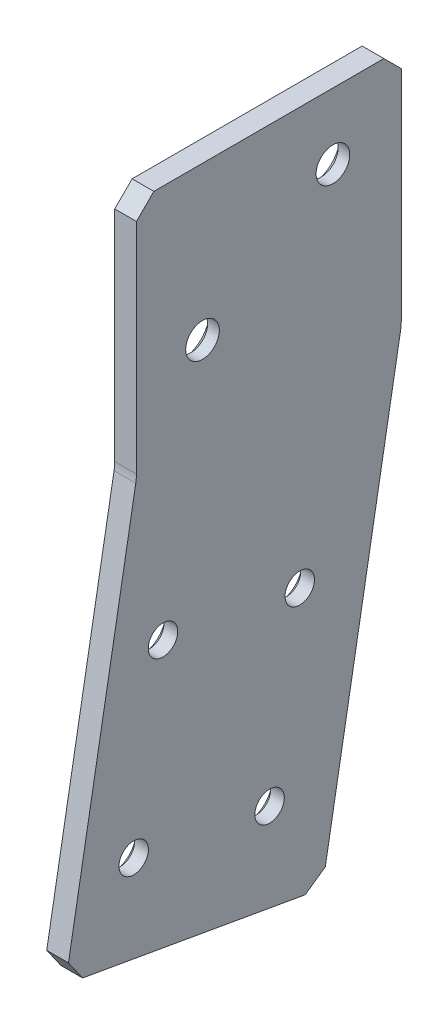
ISO-10303-21;
HEADER;
FILE_DESCRIPTION(('STEP AP214'),'2;1');
FILE_NAME('part.step','',(''),(''),'','','');
FILE_SCHEMA(('AUTOMOTIVE_DESIGN { 1 0 10303 214 1 1 1 1 }'));
ENDSEC;
DATA;
#1=APPLICATION_CONTEXT('core data for automotive mechanical design processes');
#2=APPLICATION_PROTOCOL_DEFINITION('international standard','automotive_design',2000,#1);
#3=PRODUCT_CONTEXT('',#1,'mechanical');
#4=PRODUCT('Part','Part','',(#3));
#5=PRODUCT_RELATED_PRODUCT_CATEGORY('part','',(#4));
#6=PRODUCT_DEFINITION_FORMATION('','',#4);
#7=PRODUCT_DEFINITION_CONTEXT('part definition',#1,'design');
#8=PRODUCT_DEFINITION('design','',#6,#7);
#9=PRODUCT_DEFINITION_SHAPE('','',#8);
#10=(LENGTH_UNIT() NAMED_UNIT(*) SI_UNIT(.MILLI.,.METRE.));
#11=(NAMED_UNIT(*) PLANE_ANGLE_UNIT() SI_UNIT($,.RADIAN.));
#12=(NAMED_UNIT(*) SI_UNIT($,.STERADIAN.) SOLID_ANGLE_UNIT());
#13=UNCERTAINTY_MEASURE_WITH_UNIT(LENGTH_MEASURE(1.E-05),#10,'distance_accuracy_value','');
#14=(GEOMETRIC_REPRESENTATION_CONTEXT(3) GLOBAL_UNCERTAINTY_ASSIGNED_CONTEXT((#13)) GLOBAL_UNIT_ASSIGNED_CONTEXT((#10,
#11,#12)) REPRESENTATION_CONTEXT('',''));
#15=CARTESIAN_POINT('',(0.,0.,0.));
#16=DIRECTION('',(0.,0.,1.));
#17=DIRECTION('',(1.,0.,0.));
#18=AXIS2_PLACEMENT_3D('',#15,#16,#17);
#19=CARTESIAN_POINT('',(1.86082796489774,230.070458845019,-147.775624550014));
#20=DIRECTION('',(0.,0.984807753012208,-0.17364817766693));
#21=DIRECTION('',(0.,0.17364817766693,0.984807753012208));
#22=AXIS2_PLACEMENT_3D('',#19,#20,#21);
#23=PLANE('',#22);
#24=DIRECTION('',(0.,0.17364817766693,0.984807753012208));
#25=VECTOR('',#24,1.);
#26=CARTESIAN_POINT('',(5.03582796489774,230.070458845019,-147.775624550014));
#27=LINE('',#26,#25);
#28=CARTESIAN_POINT('',(5.03582796489774,230.511525216293,-145.274212857363));
#29=VERTEX_POINT('',#28);
#30=CARTESIAN_POINT('',(5.03582796489774,236.245388042855,-112.755860852901));
#31=VERTEX_POINT('',#30);
#32=EDGE_CURVE('E180',#29,#31,#27,.T.);
#33=ORIENTED_EDGE('',*,*,#32,.T.);
#34=DIRECTION('',(-1.,0.,0.));
#35=VECTOR('',#34,1.);
#36=CARTESIAN_POINT('',(1.86082796489774,236.245388042855,-112.755860852901));
#37=LINE('',#36,#35);
#38=CARTESIAN_POINT('',(1.86082796489774,236.245388042855,-112.755860852901));
#39=VERTEX_POINT('',#38);
#40=EDGE_CURVE('E219',#31,#39,#37,.T.);
#41=ORIENTED_EDGE('',*,*,#40,.T.);
#42=DIRECTION('',(0.,0.17364817766693,0.984807753012208));
#43=VECTOR('',#42,1.);
#44=CARTESIAN_POINT('',(1.86082796489774,230.070458845019,-147.775624550014));
#45=LINE('',#44,#43);
#46=CARTESIAN_POINT('',(1.86082796489774,230.511525216293,-145.274212857363));
#47=VERTEX_POINT('',#46);
#48=EDGE_CURVE('E188',#47,#39,#45,.T.);
#49=ORIENTED_EDGE('',*,*,#48,.F.);
#50=DIRECTION('',(1.,0.,0.));
#51=VECTOR('',#50,1.);
#52=CARTESIAN_POINT('',(1.86082796489774,230.511525216293,-145.274212857363));
#53=LINE('',#52,#51);
#54=EDGE_CURVE('E216',#47,#29,#53,.T.);
#55=ORIENTED_EDGE('',*,*,#54,.T.);
#56=EDGE_LOOP('',(#33,#41,#49,#55));
#57=FACE_BOUND('',#56,.T.);
#58=ADVANCED_FACE('F42',(#57),#23,.F.);
#59=CARTESIAN_POINT('',(1.86082796489774,236.686454414129,-110.25444916025));
#60=DIRECTION('',(0.,-0.173648177666931,-0.984807753012208));
#61=DIRECTION('',(0.,0.984807753012208,-0.173648177666931));
#62=AXIS2_PLACEMENT_3D('',#59,#60,#61);
#63=PLANE('',#62);
#64=DIRECTION('',(0.,0.984807753012208,-0.173648177666931));
#65=VECTOR('',#64,1.);
#66=CARTESIAN_POINT('',(1.86082796489774,236.686454414129,-110.25444916025));
#67=LINE('',#66,#65);
#68=CARTESIAN_POINT('',(1.86082796489774,239.18786610678,-110.695515531524));
#69=VERTEX_POINT('',#68);
#70=CARTESIAN_POINT('',(1.86082796489771,294.96406401821,-120.530364104645));
#71=VERTEX_POINT('',#70);
#72=EDGE_CURVE('E275',#69,#71,#67,.T.);
#73=ORIENTED_EDGE('',*,*,#72,.F.);
#74=DIRECTION('',(1.,0.,0.));
#75=VECTOR('',#74,1.);
#76=CARTESIAN_POINT('',(1.86082796489774,239.18786610678,-110.695515531524));
#77=LINE('',#76,#75);
#78=CARTESIAN_POINT('',(5.03582796489774,239.18786610678,-110.695515531524));
#79=VERTEX_POINT('',#78);
#80=EDGE_CURVE('E204',#69,#79,#77,.T.);
#81=ORIENTED_EDGE('',*,*,#80,.T.);
#82=DIRECTION('',(0.,0.984807753012208,-0.173648177666931));
#83=VECTOR('',#82,1.);
#84=CARTESIAN_POINT('',(5.03582796489774,236.686454414129,-110.25444916025));
#85=LINE('',#84,#83);
#86=CARTESIAN_POINT('',(5.03582796489771,294.96406401821,-120.530364104645));
#87=VERTEX_POINT('',#86);
#88=EDGE_CURVE('E172',#79,#87,#85,.T.);
#89=ORIENTED_EDGE('',*,*,#88,.T.);
#90=DIRECTION('',(1.,0.,0.));
#91=VECTOR('',#90,1.);
#92=CARTESIAN_POINT('',(1.86082796489771,294.96406401821,-120.530364104645));
#93=LINE('',#92,#91);
#94=EDGE_CURVE('E149',#87,#71,#93,.F.);
#95=ORIENTED_EDGE('',*,*,#94,.T.);
#96=EDGE_LOOP('',(#73,#81,#89,#95));
#97=FACE_BOUND('',#96,.T.);
#98=ADVANCED_FACE('F285',(#97),#63,.F.);
#99=CARTESIAN_POINT('',(1.8608279648977,330.563176933005,-120.626834873017));
#100=DIRECTION('',(0.,0.,-1.));
#101=DIRECTION('',(0.,1.,0.));
#102=AXIS2_PLACEMENT_3D('',#99,#100,#101);
#103=PLANE('',#102);
#104=DIRECTION('',(0.,1.,0.));
#105=VECTOR('',#104,1.);
#106=CARTESIAN_POINT('',(5.0358279648977,330.563176933005,-120.626834873017));
#107=LINE('',#106,#105);
#108=CARTESIAN_POINT('',(5.03582796489771,296.066729946395,-120.626834873017));
#109=VERTEX_POINT('',#108);
#110=CARTESIAN_POINT('',(5.0358279648977,328.023176933005,-120.626834873017));
#111=VERTEX_POINT('',#110);
#112=EDGE_CURVE('E161',#109,#111,#107,.T.);
#113=ORIENTED_EDGE('',*,*,#112,.T.);
#114=DIRECTION('',(-1.,0.,0.));
#115=VECTOR('',#114,1.);
#116=CARTESIAN_POINT('',(1.8608279648977,328.023176933005,-120.626834873017));
#117=LINE('',#116,#115);
#118=CARTESIAN_POINT('',(1.8608279648977,328.023176933005,-120.626834873017));
#119=VERTEX_POINT('',#118);
#120=EDGE_CURVE('E11',#111,#119,#117,.T.);
#121=ORIENTED_EDGE('',*,*,#120,.T.);
#122=DIRECTION('',(0.,1.,0.));
#123=VECTOR('',#122,1.);
#124=CARTESIAN_POINT('',(1.8608279648977,330.563176933005,-120.626834873017));
#125=LINE('',#124,#123);
#126=CARTESIAN_POINT('',(1.86082796489771,296.066729946395,-120.626834873017));
#127=VERTEX_POINT('',#126);
#128=EDGE_CURVE('E163',#127,#119,#125,.T.);
#129=ORIENTED_EDGE('',*,*,#128,.F.);
#130=DIRECTION('',(1.,0.,0.));
#131=VECTOR('',#130,1.);
#132=CARTESIAN_POINT('',(5.03582796489771,296.066729946395,-120.626834873017));
#133=LINE('',#132,#131);
#134=EDGE_CURVE('E147',#127,#109,#133,.T.);
#135=ORIENTED_EDGE('',*,*,#134,.T.);
#136=EDGE_LOOP('',(#113,#121,#129,#135));
#137=FACE_BOUND('',#136,.T.);
#138=ADVANCED_FACE('F160',(#137),#103,.F.);
#139=CARTESIAN_POINT('',(1.8608279648977,330.563176933005,-159.314588785863));
#140=DIRECTION('',(0.,-1.,0.));
#141=DIRECTION('',(1.,0.,0.));
#142=AXIS2_PLACEMENT_3D('',#139,#140,#141);
#143=PLANE('',#142);
#144=DIRECTION('',(0.,0.,-1.));
#145=VECTOR('',#144,1.);
#146=CARTESIAN_POINT('',(5.0358279648977,330.563176933005,-159.314588785863));
#147=LINE('',#146,#145);
#148=CARTESIAN_POINT('',(5.0358279648977,330.563176933005,-123.166834873017));
#149=VERTEX_POINT('',#148);
#150=CARTESIAN_POINT('',(5.0358279648977,330.563176933005,-156.774588785863));
#151=VERTEX_POINT('',#150);
#152=EDGE_CURVE('E171',#149,#151,#147,.T.);
#153=ORIENTED_EDGE('',*,*,#152,.T.);
#154=DIRECTION('',(-1.,0.,0.));
#155=VECTOR('',#154,1.);
#156=CARTESIAN_POINT('',(1.8608279648977,330.563176933005,-156.774588785863));
#157=LINE('',#156,#155);
#158=CARTESIAN_POINT('',(1.8608279648977,330.563176933005,-156.774588785863));
#159=VERTEX_POINT('',#158);
#160=EDGE_CURVE('E51',#151,#159,#157,.T.);
#161=ORIENTED_EDGE('',*,*,#160,.T.);
#162=DIRECTION('',(0.,0.,-1.));
#163=VECTOR('',#162,1.);
#164=CARTESIAN_POINT('',(1.8608279648977,330.563176933005,-159.314588785863));
#165=LINE('',#164,#163);
#166=CARTESIAN_POINT('',(1.8608279648977,330.563176933005,-123.166834873017));
#167=VERTEX_POINT('',#166);
#168=EDGE_CURVE('E240',#167,#159,#165,.T.);
#169=ORIENTED_EDGE('',*,*,#168,.F.);
#170=DIRECTION('',(1.,0.,0.));
#171=VECTOR('',#170,1.);
#172=CARTESIAN_POINT('',(1.8608279648977,330.563176933005,-123.166834873017));
#173=LINE('',#172,#171);
#174=EDGE_CURVE('E234',#167,#149,#173,.T.);
#175=ORIENTED_EDGE('',*,*,#174,.T.);
#176=EDGE_LOOP('',(#153,#161,#169,#175));
#177=FACE_BOUND('',#176,.T.);
#178=ADVANCED_FACE('F239',(#177),#143,.F.);
#179=CARTESIAN_POINT('',(1.86082796489771,295.511176933005,-159.314588785863));
#180=DIRECTION('',(0.,0.,1.));
#181=DIRECTION('',(0.,-1.,0.));
#182=AXIS2_PLACEMENT_3D('',#179,#180,#181);
#183=PLANE('',#182);
#184=DIRECTION('',(0.,-1.,0.));
#185=VECTOR('',#184,1.);
#186=CARTESIAN_POINT('',(1.86082796489771,295.511176933005,-159.314588785863));
#187=LINE('',#186,#185);
#188=CARTESIAN_POINT('',(1.8608279648977,328.023176933005,-159.314588785863));
#189=VERTEX_POINT('',#188);
#190=CARTESIAN_POINT('',(1.86082796489771,296.066729946395,-159.314588785863));
#191=VERTEX_POINT('',#190);
#192=EDGE_CURVE('E250',#189,#191,#187,.T.);
#193=ORIENTED_EDGE('',*,*,#192,.F.);
#194=DIRECTION('',(1.,0.,0.));
#195=VECTOR('',#194,1.);
#196=CARTESIAN_POINT('',(1.8608279648977,328.023176933005,-159.314588785863));
#197=LINE('',#196,#195);
#198=CARTESIAN_POINT('',(5.0358279648977,328.023176933005,-159.314588785863));
#199=VERTEX_POINT('',#198);
#200=EDGE_CURVE('E231',#189,#199,#197,.T.);
#201=ORIENTED_EDGE('',*,*,#200,.T.);
#202=DIRECTION('',(0.,-1.,0.));
#203=VECTOR('',#202,1.);
#204=CARTESIAN_POINT('',(5.03582796489771,295.511176933005,-159.314588785863));
#205=LINE('',#204,#203);
#206=CARTESIAN_POINT('',(5.03582796489771,296.066729946395,-159.314588785863));
#207=VERTEX_POINT('',#206);
#208=EDGE_CURVE('E177',#199,#207,#205,.T.);
#209=ORIENTED_EDGE('',*,*,#208,.T.);
#210=DIRECTION('',(1.,0.,0.));
#211=VECTOR('',#210,1.);
#212=CARTESIAN_POINT('',(1.86082796489771,296.066729946395,-159.314588785863));
#213=LINE('',#212,#211);
#214=EDGE_CURVE('E198',#207,#191,#213,.F.);
#215=ORIENTED_EDGE('',*,*,#214,.T.);
#216=EDGE_LOOP('',(#193,#201,#209,#215));
#217=FACE_BOUND('',#216,.T.);
#218=ADVANCED_FACE('F249',(#217),#183,.F.);
#219=CARTESIAN_POINT('',(1.86082796489774,230.070458845019,-147.775624550014));
#220=DIRECTION('',(0.,0.173648177666931,0.984807753012208));
#221=DIRECTION('',(0.,-0.984807753012208,0.173648177666931));
#222=AXIS2_PLACEMENT_3D('',#219,#220,#221);
#223=PLANE('',#222);
#224=DIRECTION('',(0.,-0.984807753012208,0.173648177666931));
#225=VECTOR('',#224,1.);
#226=CARTESIAN_POINT('',(5.03582796489774,230.070458845019,-147.775624550014));
#227=LINE('',#226,#225);
#228=CARTESIAN_POINT('',(5.03582796489771,294.96406401821,-159.21811801749));
#229=VERTEX_POINT('',#228);
#230=CARTESIAN_POINT('',(5.03582796489774,232.57187053767,-148.216690921288));
#231=VERTEX_POINT('',#230);
#232=EDGE_CURVE('E186',#229,#231,#227,.T.);
#233=ORIENTED_EDGE('',*,*,#232,.T.);
#234=DIRECTION('',(-1.,0.,0.));
#235=VECTOR('',#234,1.);
#236=CARTESIAN_POINT('',(1.86082796489774,232.57187053767,-148.216690921288));
#237=LINE('',#236,#235);
#238=CARTESIAN_POINT('',(1.86082796489774,232.57187053767,-148.216690921288));
#239=VERTEX_POINT('',#238);
#240=EDGE_CURVE('E229',#231,#239,#237,.T.);
#241=ORIENTED_EDGE('',*,*,#240,.T.);
#242=DIRECTION('',(0.,-0.984807753012208,0.173648177666931));
#243=VECTOR('',#242,1.);
#244=CARTESIAN_POINT('',(1.86082796489774,230.070458845019,-147.775624550014));
#245=LINE('',#244,#243);
#246=CARTESIAN_POINT('',(1.86082796489771,294.96406401821,-159.21811801749));
#247=VERTEX_POINT('',#246);
#248=EDGE_CURVE('E165',#247,#239,#245,.T.);
#249=ORIENTED_EDGE('',*,*,#248,.F.);
#250=DIRECTION('',(1.,0.,0.));
#251=VECTOR('',#250,1.);
#252=CARTESIAN_POINT('',(1.86082796489771,294.96406401821,-159.21811801749));
#253=LINE('',#252,#251);
#254=EDGE_CURVE('E192',#247,#229,#253,.T.);
#255=ORIENTED_EDGE('',*,*,#254,.T.);
#256=EDGE_LOOP('',(#233,#241,#249,#255));
#257=FACE_BOUND('',#256,.T.);
#258=ADVANCED_FACE('F320',(#257),#223,.F.);
#259=CARTESIAN_POINT('',(1.86082796489783,0.,0.));
#260=DIRECTION('',(-1.,0.,0.));
#261=DIRECTION('',(0.,-1.,0.));
#262=AXIS2_PLACEMENT_3D('',#259,#260,#261);
#263=PLANE('',#262);
#264=CARTESIAN_POINT('',(1.8608279648977,320.911176933005,-149.328834873017));
#265=DIRECTION('',(-1.,0.,0.));
#266=DIRECTION('',(0.,0.,1.));
#267=AXIS2_PLACEMENT_3D('',#264,#265,#266);
#268=CIRCLE('',#267,4.21640000000001);
#269=CARTESIAN_POINT('',(1.8608279648977,320.911176933005,-145.112434873017));
#270=VERTEX_POINT('',#269);
#271=EDGE_CURVE('E573',#270,#270,#268,.T.);
#272=ORIENTED_EDGE('',*,*,#271,.F.);
#273=EDGE_LOOP('',(#272));
#274=FACE_BOUND('',#273,.T.);
#275=CARTESIAN_POINT('',(1.86082796489771,308.211176933005,-130.278834873017));
#276=DIRECTION('',(-1.,0.,0.));
#277=DIRECTION('',(0.,0.,1.));
#278=AXIS2_PLACEMENT_3D('',#275,#276,#277);
#279=CIRCLE('',#278,4.21640000000001);
#280=CARTESIAN_POINT('',(1.86082796489771,308.211176933005,-126.062434873017));
#281=VERTEX_POINT('',#280);
#282=EDGE_CURVE('E561',#281,#281,#279,.T.);
#283=ORIENTED_EDGE('',*,*,#282,.F.);
#284=EDGE_LOOP('',(#283));
#285=FACE_BOUND('',#284,.T.);
#286=CARTESIAN_POINT('',(1.86082796489772,273.13941545584,-124.504125042983));
#287=DIRECTION('',(-1.,0.,0.));
#288=DIRECTION('',(0.,0.,1.));
#289=AXIS2_PLACEMENT_3D('',#286,#287,#288);
#290=CIRCLE('',#289,3.54329999999997);
#291=CARTESIAN_POINT('',(1.86082796489772,273.13941545584,-120.960825042983));
#292=VERTEX_POINT('',#291);
#293=EDGE_CURVE('E552',#292,#292,#290,.T.);
#294=ORIENTED_EDGE('',*,*,#293,.F.);
#295=EDGE_LOOP('',(#294));
#296=FACE_BOUND('',#295,.T.);
#297=CARTESIAN_POINT('',(1.86082796489772,269.72417914843,-144.485224024571));
#298=DIRECTION('',(-1.,0.,0.));
#299=DIRECTION('',(0.,0.,1.));
#300=AXIS2_PLACEMENT_3D('',#297,#298,#299);
#301=CIRCLE('',#300,3.54329999999997);
#302=CARTESIAN_POINT('',(1.86082796489772,269.72417914843,-140.941924024571));
#303=VERTEX_POINT('',#302);
#304=EDGE_CURVE('E543',#303,#303,#301,.T.);
#305=ORIENTED_EDGE('',*,*,#304,.F.);
#306=EDGE_LOOP('',(#305));
#307=FACE_BOUND('',#306,.T.);
#308=CARTESIAN_POINT('',(1.86082796489773,244.32417914843,-140.075144867288));
#309=DIRECTION('',(-1.,0.,0.));
#310=DIRECTION('',(0.,0.,1.));
#311=AXIS2_PLACEMENT_3D('',#308,#309,#310);
#312=CIRCLE('',#311,3.5433);
#313=CARTESIAN_POINT('',(1.86082796489773,244.32417914843,-136.531844867288));
#314=VERTEX_POINT('',#313);
#315=EDGE_CURVE('E534',#314,#314,#312,.T.);
#316=ORIENTED_EDGE('',*,*,#315,.F.);
#317=EDGE_LOOP('',(#316));
#318=FACE_BOUND('',#317,.T.);
#319=CARTESIAN_POINT('',(1.86082796489773,247.716621745922,-120.227402213944));
#320=DIRECTION('',(-1.,0.,0.));
#321=DIRECTION('',(0.,0.,1.));
#322=AXIS2_PLACEMENT_3D('',#319,#320,#321);
#323=CIRCLE('',#322,3.54330000000003);
#324=CARTESIAN_POINT('',(1.86082796489773,247.716621745922,-116.684102213944));
#325=VERTEX_POINT('',#324);
#326=EDGE_CURVE('E269',#325,#325,#323,.T.);
#327=ORIENTED_EDGE('',*,*,#326,.F.);
#328=EDGE_LOOP('',(#327));
#329=FACE_BOUND('',#328,.T.);
#330=ORIENTED_EDGE('',*,*,#48,.T.);
#331=DIRECTION('',(0.,-0.819152044288992,-0.573576436351046));
#332=VECTOR('',#331,1.);
#333=CARTESIAN_POINT('',(1.86082796489777,130.700278479122,-186.659342190597));
#334=LINE('',#333,#332);
#335=EDGE_CURVE('E227',#39,#69,#334,.F.);
#336=ORIENTED_EDGE('',*,*,#335,.T.);
#337=ORIENTED_EDGE('',*,*,#72,.T.);
#338=CARTESIAN_POINT('',(1.86082796489771,296.066729946395,-114.276834873017));
#339=DIRECTION('',(-1.,0.,0.));
#340=DIRECTION('',(0.,-1.,0.));
#341=AXIS2_PLACEMENT_3D('',#338,#339,#340);
#342=CIRCLE('',#341,6.35);
#343=EDGE_CURVE('E154',#71,#127,#342,.F.);
#344=ORIENTED_EDGE('',*,*,#343,.T.);
#345=ORIENTED_EDGE('',*,*,#128,.T.);
#346=DIRECTION('',(0.,-0.707106781186548,0.707106781186548));
#347=VECTOR('',#346,1.);
#348=CARTESIAN_POINT('',(1.8608279648978,103.698171029994,103.698171029994));
#349=LINE('',#348,#347);
#350=EDGE_CURVE('E67',#119,#167,#349,.F.);
#351=ORIENTED_EDGE('',*,*,#350,.T.);
#352=ORIENTED_EDGE('',*,*,#168,.T.);
#353=DIRECTION('',(0.,0.707106781186548,0.707106781186548));
#354=VECTOR('',#353,1.);
#355=CARTESIAN_POINT('',(1.86082796489773,243.668882859434,-243.668882859434));
#356=LINE('',#355,#354);
#357=EDGE_CURVE('E223',#159,#189,#356,.F.);
#358=ORIENTED_EDGE('',*,*,#357,.T.);
#359=ORIENTED_EDGE('',*,*,#192,.T.);
#360=CARTESIAN_POINT('',(1.86082796489771,296.066729946395,-152.964588785863));
#361=DIRECTION('',(-1.,0.,0.));
#362=DIRECTION('',(0.,-1.,0.));
#363=AXIS2_PLACEMENT_3D('',#360,#361,#362);
#364=CIRCLE('',#363,6.35);
#365=EDGE_CURVE('E155',#191,#247,#364,.T.);
#366=ORIENTED_EDGE('',*,*,#365,.T.);
#367=ORIENTED_EDGE('',*,*,#248,.T.);
#368=DIRECTION('',(0.,0.573576436351044,-0.819152044288993));
#369=VECTOR('',#368,1.);
#370=CARTESIAN_POINT('',(1.8608279648978,86.419002148222,60.5112367487458));
#371=LINE('',#370,#369);
#372=EDGE_CURVE('E225',#239,#47,#371,.F.);
#373=ORIENTED_EDGE('',*,*,#372,.T.);
#374=EDGE_LOOP('',(#330,#336,#337,#344,#345,#351,#352,#358,#359,#366,#367,#373));
#375=FACE_BOUND('',#374,.T.);
#376=ADVANCED_FACE('F278',(#274,#285,#296,#307,#318,#329,#375),#263,.T.);
#377=CARTESIAN_POINT('',(5.03582796489783,0.,0.));
#378=DIRECTION('',(-1.,0.,0.));
#379=DIRECTION('',(0.,-1.,0.));
#380=AXIS2_PLACEMENT_3D('',#377,#378,#379);
#381=PLANE('',#380);
#382=CARTESIAN_POINT('',(5.03582796489777,320.911176933005,-149.328834873017));
#383=DIRECTION('',(-1.,0.,0.));
#384=DIRECTION('',(0.,0.,1.));
#385=AXIS2_PLACEMENT_3D('',#382,#383,#384);
#386=CIRCLE('',#385,2.45744999999997);
#387=CARTESIAN_POINT('',(5.03582796489777,320.911176933005,-146.871384873017));
#388=VERTEX_POINT('',#387);
#389=EDGE_CURVE('E565',#388,#388,#386,.T.);
#390=ORIENTED_EDGE('',*,*,#389,.T.);
#391=EDGE_LOOP('',(#390));
#392=FACE_BOUND('',#391,.T.);
#393=CARTESIAN_POINT('',(5.03582796489778,308.211176933005,-130.278834873017));
#394=DIRECTION('',(-1.,0.,0.));
#395=DIRECTION('',(0.,0.,1.));
#396=AXIS2_PLACEMENT_3D('',#393,#394,#395);
#397=CIRCLE('',#396,2.45744999999997);
#398=CARTESIAN_POINT('',(5.03582796489778,308.211176933005,-127.821384873017));
#399=VERTEX_POINT('',#398);
#400=EDGE_CURVE('E555',#399,#399,#397,.T.);
#401=ORIENTED_EDGE('',*,*,#400,.T.);
#402=EDGE_LOOP('',(#401));
#403=FACE_BOUND('',#402,.T.);
#404=CARTESIAN_POINT('',(5.03582796489776,273.13941545584,-124.504125042983));
#405=DIRECTION('',(-1.,0.,0.));
#406=DIRECTION('',(0.,0.,1.));
#407=AXIS2_PLACEMENT_3D('',#404,#405,#406);
#408=CIRCLE('',#407,2.15264999999998);
#409=CARTESIAN_POINT('',(5.03582796489776,273.13941545584,-122.351475042983));
#410=VERTEX_POINT('',#409);
#411=EDGE_CURVE('E546',#410,#410,#408,.T.);
#412=ORIENTED_EDGE('',*,*,#411,.T.);
#413=EDGE_LOOP('',(#412));
#414=FACE_BOUND('',#413,.T.);
#415=CARTESIAN_POINT('',(5.03582796489776,269.72417914843,-144.485224024571));
#416=DIRECTION('',(-1.,0.,0.));
#417=DIRECTION('',(0.,0.,1.));
#418=AXIS2_PLACEMENT_3D('',#415,#416,#417);
#419=CIRCLE('',#418,2.15264999999998);
#420=CARTESIAN_POINT('',(5.03582796489776,269.72417914843,-142.332574024571));
#421=VERTEX_POINT('',#420);
#422=EDGE_CURVE('E537',#421,#421,#419,.T.);
#423=ORIENTED_EDGE('',*,*,#422,.T.);
#424=EDGE_LOOP('',(#423));
#425=FACE_BOUND('',#424,.T.);
#426=CARTESIAN_POINT('',(5.03582796489777,244.32417914843,-140.075144867288));
#427=DIRECTION('',(-1.,0.,0.));
#428=DIRECTION('',(0.,0.,1.));
#429=AXIS2_PLACEMENT_3D('',#426,#427,#428);
#430=CIRCLE('',#429,2.15265000000001);
#431=CARTESIAN_POINT('',(5.03582796489777,244.32417914843,-137.922494867288));
#432=VERTEX_POINT('',#431);
#433=EDGE_CURVE('E527',#432,#432,#430,.T.);
#434=ORIENTED_EDGE('',*,*,#433,.T.);
#435=EDGE_LOOP('',(#434));
#436=FACE_BOUND('',#435,.T.);
#437=CARTESIAN_POINT('',(5.03582796489777,247.716621745922,-120.227402213944));
#438=DIRECTION('',(-1.,0.,0.));
#439=DIRECTION('',(0.,0.,1.));
#440=AXIS2_PLACEMENT_3D('',#437,#438,#439);
#441=CIRCLE('',#440,2.15265000000001);
#442=CARTESIAN_POINT('',(5.03582796489777,247.716621745922,-118.074752213944));
#443=VERTEX_POINT('',#442);
#444=EDGE_CURVE('E259',#443,#443,#441,.T.);
#445=ORIENTED_EDGE('',*,*,#444,.T.);
#446=EDGE_LOOP('',(#445));
#447=FACE_BOUND('',#446,.T.);
#448=ORIENTED_EDGE('',*,*,#88,.F.);
#449=DIRECTION('',(0.,0.819152044288992,0.573576436351046));
#450=VECTOR('',#449,1.);
#451=CARTESIAN_POINT('',(5.03582796489774,239.18786610678,-110.695515531524));
#452=LINE('',#451,#450);
#453=EDGE_CURVE('E214',#79,#31,#452,.F.);
#454=ORIENTED_EDGE('',*,*,#453,.T.);
#455=ORIENTED_EDGE('',*,*,#32,.F.);
#456=DIRECTION('',(0.,-0.573576436351044,0.819152044288993));
#457=VECTOR('',#456,1.);
#458=CARTESIAN_POINT('',(5.03582796489774,230.511525216293,-145.274212857363));
#459=LINE('',#458,#457);
#460=EDGE_CURVE('E212',#29,#231,#459,.F.);
#461=ORIENTED_EDGE('',*,*,#460,.T.);
#462=ORIENTED_EDGE('',*,*,#232,.F.);
#463=CARTESIAN_POINT('',(5.03582796489771,296.066729946395,-152.964588785863));
#464=DIRECTION('',(-1.,0.,0.));
#465=DIRECTION('',(0.,-1.,0.));
#466=AXIS2_PLACEMENT_3D('',#463,#464,#465);
#467=CIRCLE('',#466,6.35);
#468=EDGE_CURVE('E195',#229,#207,#467,.F.);
#469=ORIENTED_EDGE('',*,*,#468,.T.);
#470=ORIENTED_EDGE('',*,*,#208,.F.);
#471=DIRECTION('',(0.,-0.707106781186548,-0.707106781186548));
#472=VECTOR('',#471,1.);
#473=CARTESIAN_POINT('',(5.0358279648977,328.023176933005,-159.314588785863));
#474=LINE('',#473,#472);
#475=EDGE_CURVE('E209',#199,#151,#474,.F.);
#476=ORIENTED_EDGE('',*,*,#475,.T.);
#477=ORIENTED_EDGE('',*,*,#152,.F.);
#478=DIRECTION('',(0.,0.707106781186548,-0.707106781186548));
#479=VECTOR('',#478,1.);
#480=CARTESIAN_POINT('',(5.0358279648977,330.563176933005,-123.166834873017));
#481=LINE('',#480,#479);
#482=EDGE_CURVE('E169',#149,#111,#481,.F.);
#483=ORIENTED_EDGE('',*,*,#482,.T.);
#484=ORIENTED_EDGE('',*,*,#112,.F.);
#485=CARTESIAN_POINT('',(5.03582796489771,296.066729946395,-114.276834873017));
#486=DIRECTION('',(-1.,0.,0.));
#487=DIRECTION('',(0.,-1.,0.));
#488=AXIS2_PLACEMENT_3D('',#485,#486,#487);
#489=CIRCLE('',#488,6.35);
#490=EDGE_CURVE('E143',#109,#87,#489,.T.);
#491=ORIENTED_EDGE('',*,*,#490,.T.);
#492=EDGE_LOOP('',(#448,#454,#455,#461,#462,#469,#470,#476,#477,#483,#484,#491));
#493=FACE_BOUND('',#492,.T.);
#494=ADVANCED_FACE('F167',(#392,#403,#414,#425,#436,#447,#493),#381,.F.);
#495=CARTESIAN_POINT('',(1.86082796489771,296.066729946395,-114.276834873017));
#496=DIRECTION('',(-1.,0.,0.));
#497=DIRECTION('',(0.,-1.,0.));
#498=AXIS2_PLACEMENT_3D('',#495,#496,#497);
#499=CYLINDRICAL_SURFACE('',#498,6.35);
#500=ORIENTED_EDGE('',*,*,#343,.F.);
#501=ORIENTED_EDGE('',*,*,#94,.F.);
#502=ORIENTED_EDGE('',*,*,#490,.F.);
#503=ORIENTED_EDGE('',*,*,#134,.F.);
#504=EDGE_LOOP('',(#500,#501,#502,#503));
#505=FACE_BOUND('',#504,.T.);
#506=ADVANCED_FACE('F146',(#505),#499,.F.);
#507=CARTESIAN_POINT('',(1.86082796489771,296.066729946395,-152.964588785863));
#508=DIRECTION('',(1.,0.,0.));
#509=DIRECTION('',(0.,1.,0.));
#510=AXIS2_PLACEMENT_3D('',#507,#508,#509);
#511=CYLINDRICAL_SURFACE('',#510,6.35);
#512=ORIENTED_EDGE('',*,*,#365,.F.);
#513=ORIENTED_EDGE('',*,*,#214,.F.);
#514=ORIENTED_EDGE('',*,*,#468,.F.);
#515=ORIENTED_EDGE('',*,*,#254,.F.);
#516=EDGE_LOOP('',(#512,#513,#514,#515));
#517=FACE_BOUND('',#516,.T.);
#518=ADVANCED_FACE('F296',(#517),#511,.T.);
#519=CARTESIAN_POINT('',(1.86082796489773,247.716621745922,-120.227402213944));
#520=DIRECTION('',(-1.,0.,0.));
#521=DIRECTION('',(0.,0.,1.));
#522=AXIS2_PLACEMENT_3D('',#519,#520,#521);
#523=CYLINDRICAL_SURFACE('',#522,2.15264999999999);
#524=ORIENTED_EDGE('',*,*,#444,.F.);
#525=EDGE_LOOP('',(#524));
#526=FACE_BOUND('',#525,.T.);
#527=CARTESIAN_POINT('',(3.02772186699441,247.716621745922,-120.227402213944));
#528=DIRECTION('',(-1.,0.,0.));
#529=DIRECTION('',(0.,0.,1.));
#530=AXIS2_PLACEMENT_3D('',#527,#528,#529);
#531=CIRCLE('',#530,2.15264999999998);
#532=CARTESIAN_POINT('',(3.02772186699441,247.716621745922,-118.074752213944));
#533=VERTEX_POINT('',#532);
#534=EDGE_CURVE('E264',#533,#533,#531,.T.);
#535=ORIENTED_EDGE('',*,*,#534,.T.);
#536=EDGE_LOOP('',(#535));
#537=FACE_BOUND('',#536,.T.);
#538=ADVANCED_FACE('F299',(#526,#537),#523,.F.);
#539=CARTESIAN_POINT('',(1.86082796489773,247.716621745922,-120.227402213944));
#540=DIRECTION('',(-1.,0.,0.));
#541=DIRECTION('',(0.,0.,1.));
#542=AXIS2_PLACEMENT_3D('',#539,#540,#541);
#543=CONICAL_SURFACE('',#542,3.54330000000003,0.872664625997184);
#544=ORIENTED_EDGE('',*,*,#534,.F.);
#545=EDGE_LOOP('',(#544));
#546=FACE_BOUND('',#545,.T.);
#547=ORIENTED_EDGE('',*,*,#326,.T.);
#548=EDGE_LOOP('',(#547));
#549=FACE_BOUND('',#548,.T.);
#550=ADVANCED_FACE('F466',(#546,#549),#543,.F.);
#551=CARTESIAN_POINT('',(1.86082796489773,244.32417914843,-140.075144867288));
#552=DIRECTION('',(-1.,0.,0.));
#553=DIRECTION('',(0.,0.,1.));
#554=AXIS2_PLACEMENT_3D('',#551,#552,#553);
#555=CYLINDRICAL_SURFACE('',#554,2.15264999999999);
#556=ORIENTED_EDGE('',*,*,#433,.F.);
#557=EDGE_LOOP('',(#556));
#558=FACE_BOUND('',#557,.T.);
#559=CARTESIAN_POINT('',(3.02772186699441,244.32417914843,-140.075144867288));
#560=DIRECTION('',(-1.,0.,0.));
#561=DIRECTION('',(0.,0.,1.));
#562=AXIS2_PLACEMENT_3D('',#559,#560,#561);
#563=CIRCLE('',#562,2.15264999999998);
#564=CARTESIAN_POINT('',(3.02772186699441,244.32417914843,-137.922494867288));
#565=VERTEX_POINT('',#564);
#566=EDGE_CURVE('E529',#565,#565,#563,.T.);
#567=ORIENTED_EDGE('',*,*,#566,.T.);
#568=EDGE_LOOP('',(#567));
#569=FACE_BOUND('',#568,.T.);
#570=ADVANCED_FACE('F458',(#558,#569),#555,.F.);
#571=CARTESIAN_POINT('',(1.86082796489773,244.32417914843,-140.075144867288));
#572=DIRECTION('',(-1.,0.,0.));
#573=DIRECTION('',(0.,0.,1.));
#574=AXIS2_PLACEMENT_3D('',#571,#572,#573);
#575=CONICAL_SURFACE('',#574,3.5433,0.872664625997174);
#576=ORIENTED_EDGE('',*,*,#566,.F.);
#577=EDGE_LOOP('',(#576));
#578=FACE_BOUND('',#577,.T.);
#579=ORIENTED_EDGE('',*,*,#315,.T.);
#580=EDGE_LOOP('',(#579));
#581=FACE_BOUND('',#580,.T.);
#582=ADVANCED_FACE('F450',(#578,#581),#575,.F.);
#583=CARTESIAN_POINT('',(1.86082796489772,269.72417914843,-144.485224024571));
#584=DIRECTION('',(-1.,0.,0.));
#585=DIRECTION('',(0.,0.,1.));
#586=AXIS2_PLACEMENT_3D('',#583,#584,#585);
#587=CYLINDRICAL_SURFACE('',#586,2.15264999999998);
#588=ORIENTED_EDGE('',*,*,#422,.F.);
#589=EDGE_LOOP('',(#588));
#590=FACE_BOUND('',#589,.T.);
#591=CARTESIAN_POINT('',(3.0277218669944,269.72417914843,-144.485224024571));
#592=DIRECTION('',(-1.,0.,0.));
#593=DIRECTION('',(0.,0.,1.));
#594=AXIS2_PLACEMENT_3D('',#591,#592,#593);
#595=CIRCLE('',#594,2.15264999999998);
#596=CARTESIAN_POINT('',(3.0277218669944,269.72417914843,-142.332574024571));
#597=VERTEX_POINT('',#596);
#598=EDGE_CURVE('E540',#597,#597,#595,.T.);
#599=ORIENTED_EDGE('',*,*,#598,.T.);
#600=EDGE_LOOP('',(#599));
#601=FACE_BOUND('',#600,.T.);
#602=ADVANCED_FACE('F442',(#590,#601),#587,.F.);
#603=CARTESIAN_POINT('',(1.86082796489772,269.72417914843,-144.485224024571));
#604=DIRECTION('',(-1.,0.,0.));
#605=DIRECTION('',(0.,0.,1.));
#606=AXIS2_PLACEMENT_3D('',#603,#604,#605);
#607=CONICAL_SURFACE('',#606,3.54329999999997,0.872664625997165);
#608=ORIENTED_EDGE('',*,*,#598,.F.);
#609=EDGE_LOOP('',(#608));
#610=FACE_BOUND('',#609,.T.);
#611=ORIENTED_EDGE('',*,*,#304,.T.);
#612=EDGE_LOOP('',(#611));
#613=FACE_BOUND('',#612,.T.);
#614=ADVANCED_FACE('F434',(#610,#613),#607,.F.);
#615=CARTESIAN_POINT('',(1.86082796489772,273.13941545584,-124.504125042983));
#616=DIRECTION('',(-1.,0.,0.));
#617=DIRECTION('',(0.,0.,1.));
#618=AXIS2_PLACEMENT_3D('',#615,#616,#617);
#619=CYLINDRICAL_SURFACE('',#618,2.15264999999998);
#620=ORIENTED_EDGE('',*,*,#411,.F.);
#621=EDGE_LOOP('',(#620));
#622=FACE_BOUND('',#621,.T.);
#623=CARTESIAN_POINT('',(3.0277218669944,273.13941545584,-124.504125042983));
#624=DIRECTION('',(-1.,0.,0.));
#625=DIRECTION('',(0.,0.,1.));
#626=AXIS2_PLACEMENT_3D('',#623,#624,#625);
#627=CIRCLE('',#626,2.15264999999998);
#628=CARTESIAN_POINT('',(3.0277218669944,273.13941545584,-122.351475042983));
#629=VERTEX_POINT('',#628);
#630=EDGE_CURVE('E549',#629,#629,#627,.T.);
#631=ORIENTED_EDGE('',*,*,#630,.T.);
#632=EDGE_LOOP('',(#631));
#633=FACE_BOUND('',#632,.T.);
#634=ADVANCED_FACE('F426',(#622,#633),#619,.F.);
#635=CARTESIAN_POINT('',(1.86082796489772,273.13941545584,-124.504125042983));
#636=DIRECTION('',(-1.,0.,0.));
#637=DIRECTION('',(0.,0.,1.));
#638=AXIS2_PLACEMENT_3D('',#635,#636,#637);
#639=CONICAL_SURFACE('',#638,3.54329999999997,0.872664625997165);
#640=ORIENTED_EDGE('',*,*,#630,.F.);
#641=EDGE_LOOP('',(#640));
#642=FACE_BOUND('',#641,.T.);
#643=ORIENTED_EDGE('',*,*,#293,.T.);
#644=EDGE_LOOP('',(#643));
#645=FACE_BOUND('',#644,.T.);
#646=ADVANCED_FACE('F418',(#642,#645),#639,.F.);
#647=CARTESIAN_POINT('',(1.86082796489771,308.211176933005,-130.278834873017));
#648=DIRECTION('',(-1.,0.,0.));
#649=DIRECTION('',(0.,0.,1.));
#650=AXIS2_PLACEMENT_3D('',#647,#648,#649);
#651=CYLINDRICAL_SURFACE('',#650,2.45744999999997);
#652=ORIENTED_EDGE('',*,*,#400,.F.);
#653=EDGE_LOOP('',(#652));
#654=FACE_BOUND('',#653,.T.);
#655=CARTESIAN_POINT('',(3.33676226115699,308.211176933005,-130.278834873017));
#656=DIRECTION('',(-1.,0.,0.));
#657=DIRECTION('',(0.,0.,1.));
#658=AXIS2_PLACEMENT_3D('',#655,#656,#657);
#659=CIRCLE('',#658,2.45744999999997);
#660=CARTESIAN_POINT('',(3.33676226115699,308.211176933005,-127.821384873017));
#661=VERTEX_POINT('',#660);
#662=EDGE_CURVE('E558',#661,#661,#659,.T.);
#663=ORIENTED_EDGE('',*,*,#662,.T.);
#664=EDGE_LOOP('',(#663));
#665=FACE_BOUND('',#664,.T.);
#666=ADVANCED_FACE('F410',(#654,#665),#651,.F.);
#667=CARTESIAN_POINT('',(1.86082796489771,308.211176933005,-130.278834873017));
#668=DIRECTION('',(-1.,0.,0.));
#669=DIRECTION('',(0.,0.,1.));
#670=AXIS2_PLACEMENT_3D('',#667,#668,#669);
#671=CONICAL_SURFACE('',#670,4.21640000000001,0.872664625997174);
#672=ORIENTED_EDGE('',*,*,#662,.F.);
#673=EDGE_LOOP('',(#672));
#674=FACE_BOUND('',#673,.T.);
#675=ORIENTED_EDGE('',*,*,#282,.T.);
#676=EDGE_LOOP('',(#675));
#677=FACE_BOUND('',#676,.T.);
#678=ADVANCED_FACE('F402',(#674,#677),#671,.F.);
#679=CARTESIAN_POINT('',(1.8608279648977,320.911176933005,-149.328834873017));
#680=DIRECTION('',(-1.,0.,0.));
#681=DIRECTION('',(0.,0.,1.));
#682=AXIS2_PLACEMENT_3D('',#679,#680,#681);
#683=CYLINDRICAL_SURFACE('',#682,2.45744999999997);
#684=ORIENTED_EDGE('',*,*,#389,.F.);
#685=EDGE_LOOP('',(#684));
#686=FACE_BOUND('',#685,.T.);
#687=CARTESIAN_POINT('',(3.33676226115698,320.911176933005,-149.328834873017));
#688=DIRECTION('',(-1.,0.,0.));
#689=DIRECTION('',(0.,0.,1.));
#690=AXIS2_PLACEMENT_3D('',#687,#688,#689);
#691=CIRCLE('',#690,2.45744999999997);
#692=CARTESIAN_POINT('',(3.33676226115698,320.911176933005,-146.871384873017));
#693=VERTEX_POINT('',#692);
#694=EDGE_CURVE('E569',#693,#693,#691,.T.);
#695=ORIENTED_EDGE('',*,*,#694,.T.);
#696=EDGE_LOOP('',(#695));
#697=FACE_BOUND('',#696,.T.);
#698=ADVANCED_FACE('F395',(#686,#697),#683,.F.);
#699=CARTESIAN_POINT('',(1.8608279648977,320.911176933005,-149.328834873017));
#700=DIRECTION('',(-1.,0.,0.));
#701=DIRECTION('',(0.,0.,1.));
#702=AXIS2_PLACEMENT_3D('',#699,#700,#701);
#703=CONICAL_SURFACE('',#702,4.21640000000001,0.872664625997174);
#704=ORIENTED_EDGE('',*,*,#694,.F.);
#705=EDGE_LOOP('',(#704));
#706=FACE_BOUND('',#705,.T.);
#707=ORIENTED_EDGE('',*,*,#271,.T.);
#708=EDGE_LOOP('',(#707));
#709=FACE_BOUND('',#708,.T.);
#710=ADVANCED_FACE('F304',(#706,#709),#703,.F.);
#711=CARTESIAN_POINT('',(1.86082796489774,239.18786610678,-110.695515531524));
#712=DIRECTION('',(0.,0.573576436351046,-0.819152044288992));
#713=DIRECTION('',(1.,0.,0.));
#714=AXIS2_PLACEMENT_3D('',#711,#712,#713);
#715=PLANE('',#714);
#716=ORIENTED_EDGE('',*,*,#335,.F.);
#717=ORIENTED_EDGE('',*,*,#40,.F.);
#718=ORIENTED_EDGE('',*,*,#453,.F.);
#719=ORIENTED_EDGE('',*,*,#80,.F.);
#720=EDGE_LOOP('',(#716,#717,#718,#719));
#721=FACE_BOUND('',#720,.T.);
#722=ADVANCED_FACE('F301',(#721),#715,.F.);
#723=CARTESIAN_POINT('',(1.86082796489774,230.511525216293,-145.274212857363));
#724=DIRECTION('',(0.,0.819152044288993,0.573576436351044));
#725=DIRECTION('',(1.,0.,0.));
#726=AXIS2_PLACEMENT_3D('',#723,#724,#725);
#727=PLANE('',#726);
#728=ORIENTED_EDGE('',*,*,#372,.F.);
#729=ORIENTED_EDGE('',*,*,#240,.F.);
#730=ORIENTED_EDGE('',*,*,#460,.F.);
#731=ORIENTED_EDGE('',*,*,#54,.F.);
#732=EDGE_LOOP('',(#728,#729,#730,#731));
#733=FACE_BOUND('',#732,.T.);
#734=ADVANCED_FACE('F283',(#733),#727,.F.);
#735=CARTESIAN_POINT('',(1.8608279648977,328.023176933005,-159.314588785863));
#736=DIRECTION('',(0.,-0.707106781186548,0.707106781186548));
#737=DIRECTION('',(1.,0.,0.));
#738=AXIS2_PLACEMENT_3D('',#735,#736,#737);
#739=PLANE('',#738);
#740=ORIENTED_EDGE('',*,*,#357,.F.);
#741=ORIENTED_EDGE('',*,*,#160,.F.);
#742=ORIENTED_EDGE('',*,*,#475,.F.);
#743=ORIENTED_EDGE('',*,*,#200,.F.);
#744=EDGE_LOOP('',(#740,#741,#742,#743));
#745=FACE_BOUND('',#744,.T.);
#746=ADVANCED_FACE('F246',(#745),#739,.F.);
#747=CARTESIAN_POINT('',(1.8608279648977,330.563176933005,-123.166834873017));
#748=DIRECTION('',(0.,-0.707106781186548,-0.707106781186548));
#749=DIRECTION('',(1.,0.,0.));
#750=AXIS2_PLACEMENT_3D('',#747,#748,#749);
#751=PLANE('',#750);
#752=ORIENTED_EDGE('',*,*,#350,.F.);
#753=ORIENTED_EDGE('',*,*,#120,.F.);
#754=ORIENTED_EDGE('',*,*,#482,.F.);
#755=ORIENTED_EDGE('',*,*,#174,.F.);
#756=EDGE_LOOP('',(#752,#753,#754,#755));
#757=FACE_BOUND('',#756,.T.);
#758=ADVANCED_FACE('F44',(#757),#751,.F.);
#759=CLOSED_SHELL('',(#58,#98,#138,#178,#218,#258,#376,#494,#506,#518,#538,#550,#570,#582,#602,
#614,#634,#646,#666,#678,#698,#710,#722,#734,#746,#758));
#760=MANIFOLD_SOLID_BREP('B2',#759);
#761=ADVANCED_BREP_SHAPE_REPRESENTATION('',(#18,#760),#14);
#762=SHAPE_DEFINITION_REPRESENTATION(#9,#761);
ENDSEC;
END-ISO-10303-21;
